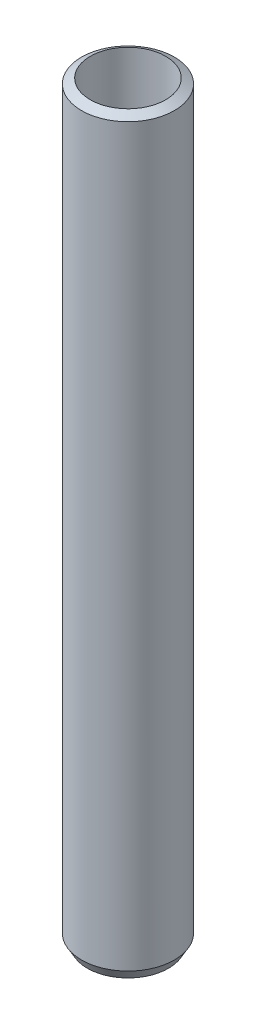
ISO-10303-21;
HEADER;
FILE_DESCRIPTION(('STEP AP214'),'2;1');
FILE_NAME('part.step','',(''),(''),'','','');
FILE_SCHEMA(('AUTOMOTIVE_DESIGN { 1 0 10303 214 1 1 1 1 }'));
ENDSEC;
DATA;
#1=APPLICATION_CONTEXT('core data for automotive mechanical design processes');
#2=APPLICATION_PROTOCOL_DEFINITION('international standard','automotive_design',2000,#1);
#3=PRODUCT_CONTEXT('',#1,'mechanical');
#4=PRODUCT('Part','Part','',(#3));
#5=PRODUCT_RELATED_PRODUCT_CATEGORY('part','',(#4));
#6=PRODUCT_DEFINITION_FORMATION('','',#4);
#7=PRODUCT_DEFINITION_CONTEXT('part definition',#1,'design');
#8=PRODUCT_DEFINITION('design','',#6,#7);
#9=PRODUCT_DEFINITION_SHAPE('','',#8);
#10=(LENGTH_UNIT() NAMED_UNIT(*) SI_UNIT(.MILLI.,.METRE.));
#11=(NAMED_UNIT(*) PLANE_ANGLE_UNIT() SI_UNIT($,.RADIAN.));
#12=(NAMED_UNIT(*) SI_UNIT($,.STERADIAN.) SOLID_ANGLE_UNIT());
#13=UNCERTAINTY_MEASURE_WITH_UNIT(LENGTH_MEASURE(1.E-05),#10,'distance_accuracy_value','');
#14=(GEOMETRIC_REPRESENTATION_CONTEXT(3) GLOBAL_UNCERTAINTY_ASSIGNED_CONTEXT((#13)) GLOBAL_UNIT_ASSIGNED_CONTEXT((#10,
#11,#12)) REPRESENTATION_CONTEXT('',''));
#15=CARTESIAN_POINT('',(0.,0.,0.));
#16=DIRECTION('',(0.,0.,1.));
#17=DIRECTION('',(1.,0.,0.));
#18=AXIS2_PLACEMENT_3D('',#15,#16,#17);
#19=CARTESIAN_POINT('',(0.,404.784879620826,0.));
#20=DIRECTION('',(0.,-1.,0.));
#21=DIRECTION('',(0.,0.,-1.));
#22=AXIS2_PLACEMENT_3D('',#19,#20,#21);
#23=CYLINDRICAL_SURFACE('',#22,25.);
#24=CARTESIAN_POINT('',(0.,401.640325908121,0.));
#25=DIRECTION('',(0.,1.,0.));
#26=DIRECTION('',(0.,0.,1.));
#27=AXIS2_PLACEMENT_3D('',#24,#25,#26);
#28=CIRCLE('',#27,25.);
#29=CARTESIAN_POINT('',(0.,401.640325908121,25.));
#30=VERTEX_POINT('',#29);
#31=EDGE_CURVE('E50',#30,#30,#28,.F.);
#32=ORIENTED_EDGE('',*,*,#31,.T.);
#33=EDGE_LOOP('',(#32));
#34=FACE_BOUND('',#33,.T.);
#35=CARTESIAN_POINT('',(0.,5.44652679753466,0.));
#36=DIRECTION('',(0.,1.,0.));
#37=DIRECTION('',(0.,0.,1.));
#38=AXIS2_PLACEMENT_3D('',#35,#36,#37);
#39=CIRCLE('',#38,25.);
#40=CARTESIAN_POINT('',(0.,5.44652679753466,25.));
#41=VERTEX_POINT('',#40);
#42=EDGE_CURVE('E51',#41,#41,#39,.T.);
#43=ORIENTED_EDGE('',*,*,#42,.T.);
#44=EDGE_LOOP('',(#43));
#45=FACE_BOUND('',#44,.T.);
#46=ADVANCED_FACE('F39',(#34,#45),#23,.T.);
#47=CARTESIAN_POINT('',(0.,0.,0.));
#48=DIRECTION('',(0.,1.,0.));
#49=DIRECTION('',(0.,0.,1.));
#50=AXIS2_PLACEMENT_3D('',#47,#48,#49);
#51=PLANE('',#50);
#52=CARTESIAN_POINT('',(0.,0.,0.));
#53=DIRECTION('',(0.,1.,0.));
#54=DIRECTION('',(0.,0.,1.));
#55=AXIS2_PLACEMENT_3D('',#52,#53,#54);
#56=CIRCLE('',#55,21.8554462872948);
#57=CARTESIAN_POINT('',(0.,0.,21.8554462872948));
#58=VERTEX_POINT('',#57);
#59=EDGE_CURVE('E10',#58,#58,#56,.F.);
#60=ORIENTED_EDGE('',*,*,#59,.T.);
#61=EDGE_LOOP('',(#60));
#62=FACE_BOUND('',#61,.T.);
#63=CARTESIAN_POINT('',(0.,0.,0.));
#64=DIRECTION('',(0.,1.,0.));
#65=DIRECTION('',(0.,0.,1.));
#66=AXIS2_PLACEMENT_3D('',#63,#64,#65);
#67=CIRCLE('',#66,20.3120557644076);
#68=CARTESIAN_POINT('',(0.,0.,20.3120557644076));
#69=VERTEX_POINT('',#68);
#70=EDGE_CURVE('E58',#69,#69,#67,.T.);
#71=ORIENTED_EDGE('',*,*,#70,.T.);
#72=EDGE_LOOP('',(#71));
#73=FACE_BOUND('',#72,.T.);
#74=ADVANCED_FACE('F62',(#62,#73),#51,.F.);
#75=CARTESIAN_POINT('',(0.,404.784879620826,0.));
#76=DIRECTION('',(0.,-1.,0.));
#77=DIRECTION('',(0.,0.,-1.));
#78=AXIS2_PLACEMENT_3D('',#75,#76,#77);
#79=CYLINDRICAL_SURFACE('',#78,20.3120557644076);
#80=CARTESIAN_POINT('',(0.,404.346911774486,0.));
#81=DIRECTION('',(0.,-1.,0.));
#82=DIRECTION('',(0.,0.,-1.));
#83=AXIS2_PLACEMENT_3D('',#80,#81,#82);
#84=CIRCLE('',#83,20.3120557644076);
#85=CARTESIAN_POINT('',(0.,404.346911774486,-20.3120557644076));
#86=VERTEX_POINT('',#85);
#87=EDGE_CURVE('E54',#86,#86,#84,.F.);
#88=ORIENTED_EDGE('',*,*,#87,.T.);
#89=EDGE_LOOP('',(#88));
#90=FACE_BOUND('',#89,.T.);
#91=ORIENTED_EDGE('',*,*,#70,.F.);
#92=EDGE_LOOP('',(#91));
#93=FACE_BOUND('',#92,.T.);
#94=ADVANCED_FACE('F68',(#90,#93),#79,.F.);
#95=CARTESIAN_POINT('',(0.,404.784879620826,0.));
#96=DIRECTION('',(0.,-1.,0.));
#97=DIRECTION('',(0.,0.,-1.));
#98=AXIS2_PLACEMENT_3D('',#95,#96,#97);
#99=CONICAL_SURFACE('',#98,19.5534732024654,1.0471975511966);
#100=ORIENTED_EDGE('',*,*,#31,.F.);
#101=EDGE_LOOP('',(#100));
#102=FACE_BOUND('',#101,.T.);
#103=ORIENTED_EDGE('',*,*,#87,.F.);
#104=EDGE_LOOP('',(#103));
#105=FACE_BOUND('',#104,.T.);
#106=ADVANCED_FACE('F66',(#102,#105),#99,.T.);
#107=CARTESIAN_POINT('',(0.,5.44652679753466,0.));
#108=DIRECTION('',(0.,1.,0.));
#109=DIRECTION('',(0.,0.,1.));
#110=AXIS2_PLACEMENT_3D('',#107,#108,#109);
#111=CONICAL_SURFACE('',#110,25.,0.523598775598303);
#112=ORIENTED_EDGE('',*,*,#59,.F.);
#113=EDGE_LOOP('',(#112));
#114=FACE_BOUND('',#113,.T.);
#115=ORIENTED_EDGE('',*,*,#42,.F.);
#116=EDGE_LOOP('',(#115));
#117=FACE_BOUND('',#116,.T.);
#118=ADVANCED_FACE('F45',(#114,#117),#111,.T.);
#119=CLOSED_SHELL('',(#46,#74,#94,#106,#118));
#120=MANIFOLD_SOLID_BREP('B2',#119);
#121=ADVANCED_BREP_SHAPE_REPRESENTATION('',(#18,#120),#14);
#122=SHAPE_DEFINITION_REPRESENTATION(#9,#121);
ENDSEC;
END-ISO-10303-21;
